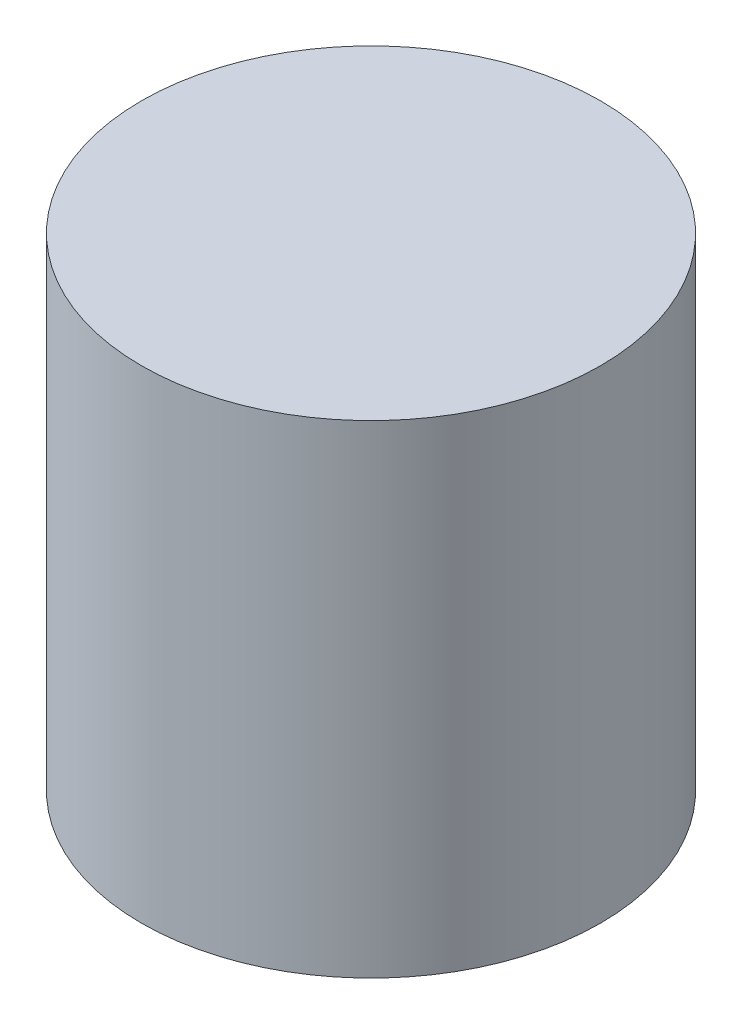
ISO-10303-21;
HEADER;
FILE_DESCRIPTION(('STEP AP214'),'2;1');
FILE_NAME('part.step','',(''),(''),'','','');
FILE_SCHEMA(('AUTOMOTIVE_DESIGN { 1 0 10303 214 1 1 1 1 }'));
ENDSEC;
DATA;
#1=APPLICATION_CONTEXT('core data for automotive mechanical design processes');
#2=APPLICATION_PROTOCOL_DEFINITION('international standard','automotive_design',2000,#1);
#3=PRODUCT_CONTEXT('',#1,'mechanical');
#4=PRODUCT('Part','Part','',(#3));
#5=PRODUCT_RELATED_PRODUCT_CATEGORY('part','',(#4));
#6=PRODUCT_DEFINITION_FORMATION('','',#4);
#7=PRODUCT_DEFINITION_CONTEXT('part definition',#1,'design');
#8=PRODUCT_DEFINITION('design','',#6,#7);
#9=PRODUCT_DEFINITION_SHAPE('','',#8);
#10=(LENGTH_UNIT() NAMED_UNIT(*) SI_UNIT(.MILLI.,.METRE.));
#11=(NAMED_UNIT(*) PLANE_ANGLE_UNIT() SI_UNIT($,.RADIAN.));
#12=(NAMED_UNIT(*) SI_UNIT($,.STERADIAN.) SOLID_ANGLE_UNIT());
#13=UNCERTAINTY_MEASURE_WITH_UNIT(LENGTH_MEASURE(1.E-05),#10,'distance_accuracy_value','');
#14=(GEOMETRIC_REPRESENTATION_CONTEXT(3) GLOBAL_UNCERTAINTY_ASSIGNED_CONTEXT((#13)) GLOBAL_UNIT_ASSIGNED_CONTEXT((#10,
#11,#12)) REPRESENTATION_CONTEXT('',''));
#15=CARTESIAN_POINT('',(0.,0.,0.));
#16=DIRECTION('',(0.,0.,1.));
#17=DIRECTION('',(1.,0.,0.));
#18=AXIS2_PLACEMENT_3D('',#15,#16,#17);
#19=CARTESIAN_POINT('',(0.,142.,0.));
#20=DIRECTION('',(0.,-1.,0.));
#21=DIRECTION('',(0.,0.,-1.));
#22=AXIS2_PLACEMENT_3D('',#19,#20,#21);
#23=CYLINDRICAL_SURFACE('',#22,67.5);
#24=CARTESIAN_POINT('',(0.,142.,0.));
#25=DIRECTION('',(0.,1.,0.));
#26=DIRECTION('',(0.,0.,1.));
#27=AXIS2_PLACEMENT_3D('',#24,#25,#26);
#28=CIRCLE('',#27,67.5);
#29=CARTESIAN_POINT('',(0.,142.,67.5));
#30=VERTEX_POINT('',#29);
#31=EDGE_CURVE('E10',#30,#30,#28,.T.);
#32=ORIENTED_EDGE('',*,*,#31,.F.);
#33=EDGE_LOOP('',(#32));
#34=FACE_BOUND('',#33,.T.);
#35=CARTESIAN_POINT('',(0.,0.,0.));
#36=DIRECTION('',(0.,1.,0.));
#37=DIRECTION('',(0.,0.,1.));
#38=AXIS2_PLACEMENT_3D('',#35,#36,#37);
#39=CIRCLE('',#38,67.5);
#40=CARTESIAN_POINT('',(0.,0.,67.5));
#41=VERTEX_POINT('',#40);
#42=EDGE_CURVE('E35',#41,#41,#39,.T.);
#43=ORIENTED_EDGE('',*,*,#42,.T.);
#44=EDGE_LOOP('',(#43));
#45=FACE_BOUND('',#44,.T.);
#46=ADVANCED_FACE('F29',(#34,#45),#23,.T.);
#47=CARTESIAN_POINT('',(0.,142.,0.));
#48=DIRECTION('',(0.,1.,0.));
#49=DIRECTION('',(0.,0.,1.));
#50=AXIS2_PLACEMENT_3D('',#47,#48,#49);
#51=PLANE('',#50);
#52=ORIENTED_EDGE('',*,*,#31,.T.);
#53=EDGE_LOOP('',(#52));
#54=FACE_BOUND('',#53,.T.);
#55=ADVANCED_FACE('F44',(#54),#51,.T.);
#56=CARTESIAN_POINT('',(0.,0.,0.));
#57=DIRECTION('',(0.,1.,0.));
#58=DIRECTION('',(0.,0.,1.));
#59=AXIS2_PLACEMENT_3D('',#56,#57,#58);
#60=PLANE('',#59);
#61=ORIENTED_EDGE('',*,*,#42,.F.);
#62=EDGE_LOOP('',(#61));
#63=FACE_BOUND('',#62,.T.);
#64=ADVANCED_FACE('F42',(#63),#60,.F.);
#65=CLOSED_SHELL('',(#46,#55,#64));
#66=MANIFOLD_SOLID_BREP('B2',#65);
#67=ADVANCED_BREP_SHAPE_REPRESENTATION('',(#18,#66),#14);
#68=SHAPE_DEFINITION_REPRESENTATION(#9,#67);
ENDSEC;
END-ISO-10303-21;
